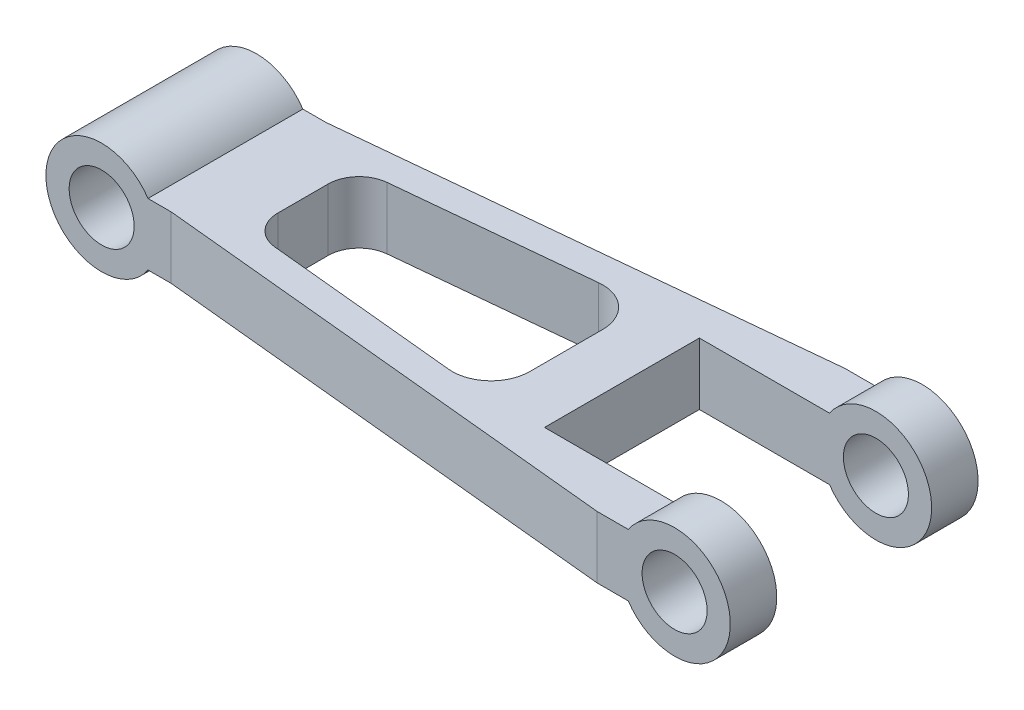
ISO-10303-21;
HEADER;
FILE_DESCRIPTION(('STEP AP214'),'2;1');
FILE_NAME('part.step','',(''),(''),'','','');
FILE_SCHEMA(('AUTOMOTIVE_DESIGN { 1 0 10303 214 1 1 1 1 }'));
ENDSEC;
DATA;
#1=APPLICATION_CONTEXT('core data for automotive mechanical design processes');
#2=APPLICATION_PROTOCOL_DEFINITION('international standard','automotive_design',2000,#1);
#3=PRODUCT_CONTEXT('',#1,'mechanical');
#4=PRODUCT('Part','Part','',(#3));
#5=PRODUCT_RELATED_PRODUCT_CATEGORY('part','',(#4));
#6=PRODUCT_DEFINITION_FORMATION('','',#4);
#7=PRODUCT_DEFINITION_CONTEXT('part definition',#1,'design');
#8=PRODUCT_DEFINITION('design','',#6,#7);
#9=PRODUCT_DEFINITION_SHAPE('','',#8);
#10=(LENGTH_UNIT() NAMED_UNIT(*) SI_UNIT(.MILLI.,.METRE.));
#11=(NAMED_UNIT(*) PLANE_ANGLE_UNIT() SI_UNIT($,.RADIAN.));
#12=(NAMED_UNIT(*) SI_UNIT($,.STERADIAN.) SOLID_ANGLE_UNIT());
#13=UNCERTAINTY_MEASURE_WITH_UNIT(LENGTH_MEASURE(1.E-05),#10,'distance_accuracy_value','');
#14=(GEOMETRIC_REPRESENTATION_CONTEXT(3) GLOBAL_UNCERTAINTY_ASSIGNED_CONTEXT((#13)) GLOBAL_UNIT_ASSIGNED_CONTEXT((#10,
#11,#12)) REPRESENTATION_CONTEXT('',''));
#15=CARTESIAN_POINT('',(0.,0.,0.));
#16=DIRECTION('',(0.,0.,1.));
#17=DIRECTION('',(1.,0.,0.));
#18=AXIS2_PLACEMENT_3D('',#15,#16,#17);
#19=CARTESIAN_POINT('',(400.,0.,160.));
#20=DIRECTION('',(0.,0.,-1.));
#21=DIRECTION('',(-1.,0.,0.));
#22=AXIS2_PLACEMENT_3D('',#19,#20,#21);
#23=CYLINDRICAL_SURFACE('',#22,36.);
#24=CARTESIAN_POINT('',(400.,0.,30.));
#25=DIRECTION('',(0.,0.,1.));
#26=DIRECTION('',(1.,0.,0.));
#27=AXIS2_PLACEMENT_3D('',#24,#25,#26);
#28=CIRCLE('',#27,36.);
#29=CARTESIAN_POINT('',(370.066740905809,-20.,30.));
#30=VERTEX_POINT('',#29);
#31=CARTESIAN_POINT('',(370.066740905809,20.,30.));
#32=VERTEX_POINT('',#31);
#33=EDGE_CURVE('E247',#30,#32,#28,.T.);
#34=ORIENTED_EDGE('',*,*,#33,.F.);
#35=DIRECTION('',(0.,0.,-1.));
#36=VECTOR('',#35,1.);
#37=CARTESIAN_POINT('',(370.066740905809,-20.,160.));
#38=LINE('',#37,#36);
#39=CARTESIAN_POINT('',(370.066740905809,-20.,0.));
#40=VERTEX_POINT('',#39);
#41=EDGE_CURVE('E245',#30,#40,#38,.T.);
#42=ORIENTED_EDGE('',*,*,#41,.T.);
#43=CARTESIAN_POINT('',(400.,0.,0.));
#44=DIRECTION('',(0.,0.,1.));
#45=DIRECTION('',(1.,0.,0.));
#46=AXIS2_PLACEMENT_3D('',#43,#44,#45);
#47=CIRCLE('',#46,36.);
#48=CARTESIAN_POINT('',(370.066740905809,20.,0.));
#49=VERTEX_POINT('',#48);
#50=EDGE_CURVE('E378',#40,#49,#47,.T.);
#51=ORIENTED_EDGE('',*,*,#50,.T.);
#52=DIRECTION('',(0.,0.,-1.));
#53=VECTOR('',#52,1.);
#54=CARTESIAN_POINT('',(370.066740905809,20.,160.));
#55=LINE('',#54,#53);
#56=EDGE_CURVE('E415',#32,#49,#55,.T.);
#57=ORIENTED_EDGE('',*,*,#56,.F.);
#58=EDGE_LOOP('',(#34,#42,#51,#57));
#59=FACE_BOUND('',#58,.T.);
#60=ADVANCED_FACE('F87',(#59),#23,.T.);
#61=CARTESIAN_POINT('',(400.,0.,160.));
#62=DIRECTION('',(0.,0.,-1.));
#63=DIRECTION('',(-1.,0.,0.));
#64=AXIS2_PLACEMENT_3D('',#61,#62,#63);
#65=CYLINDRICAL_SURFACE('',#64,21.);
#66=CARTESIAN_POINT('',(400.,0.,0.));
#67=DIRECTION('',(0.,0.,1.));
#68=DIRECTION('',(1.,0.,0.));
#69=AXIS2_PLACEMENT_3D('',#66,#67,#68);
#70=CIRCLE('',#69,21.);
#71=CARTESIAN_POINT('',(421.,0.,0.));
#72=VERTEX_POINT('',#71);
#73=EDGE_CURVE('E373',#72,#72,#70,.T.);
#74=ORIENTED_EDGE('',*,*,#73,.F.);
#75=EDGE_LOOP('',(#74));
#76=FACE_BOUND('',#75,.T.);
#77=CARTESIAN_POINT('',(400.,0.,30.));
#78=DIRECTION('',(0.,0.,1.));
#79=DIRECTION('',(1.,0.,0.));
#80=AXIS2_PLACEMENT_3D('',#77,#78,#79);
#81=CIRCLE('',#80,21.);
#82=CARTESIAN_POINT('',(421.,0.,30.));
#83=VERTEX_POINT('',#82);
#84=EDGE_CURVE('E253',#83,#83,#81,.T.);
#85=ORIENTED_EDGE('',*,*,#84,.T.);
#86=EDGE_LOOP('',(#85));
#87=FACE_BOUND('',#86,.T.);
#88=ADVANCED_FACE('F476',(#76,#87),#65,.F.);
#89=CARTESIAN_POINT('',(400.,0.,0.));
#90=DIRECTION('',(0.,0.,1.));
#91=DIRECTION('',(1.,0.,0.));
#92=AXIS2_PLACEMENT_3D('',#89,#90,#91);
#93=PLANE('',#92);
#94=ORIENTED_EDGE('',*,*,#73,.T.);
#95=EDGE_LOOP('',(#94));
#96=FACE_BOUND('',#95,.T.);
#97=DIRECTION('',(0.,1.,0.));
#98=VECTOR('',#97,1.);
#99=CARTESIAN_POINT('',(350.,-36.,0.));
#100=LINE('',#99,#98);
#101=CARTESIAN_POINT('',(350.,-20.,0.));
#102=VERTEX_POINT('',#101);
#103=CARTESIAN_POINT('',(350.,20.,0.));
#104=VERTEX_POINT('',#103);
#105=EDGE_CURVE('E333',#102,#104,#100,.T.);
#106=ORIENTED_EDGE('',*,*,#105,.T.);
#107=DIRECTION('',(-1.,0.,0.));
#108=VECTOR('',#107,1.);
#109=CARTESIAN_POINT('',(29.9332590941915,20.,0.));
#110=LINE('',#109,#108);
#111=EDGE_CURVE('E397',#49,#104,#110,.T.);
#112=ORIENTED_EDGE('',*,*,#111,.F.);
#113=ORIENTED_EDGE('',*,*,#50,.F.);
#114=DIRECTION('',(1.,0.,0.));
#115=VECTOR('',#114,1.);
#116=CARTESIAN_POINT('',(29.9332590941915,-20.,0.));
#117=LINE('',#116,#115);
#118=EDGE_CURVE('E387',#102,#40,#117,.T.);
#119=ORIENTED_EDGE('',*,*,#118,.F.);
#120=EDGE_LOOP('',(#106,#112,#113,#119));
#121=FACE_BOUND('',#120,.T.);
#122=ADVANCED_FACE('F497',(#96,#121),#93,.F.);
#123=CARTESIAN_POINT('',(29.9332590941915,20.,160.));
#124=DIRECTION('',(0.,-1.,0.));
#125=DIRECTION('',(0.,0.,-1.));
#126=AXIS2_PLACEMENT_3D('',#123,#124,#125);
#127=PLANE('',#126);
#128=CARTESIAN_POINT('',(100.,20.,96.2626990637358));
#129=DIRECTION('',(0.,-1.,0.));
#130=DIRECTION('',(0.,0.,-1.));
#131=AXIS2_PLACEMENT_3D('',#128,#129,#130);
#132=CIRCLE('',#131,20.);
#133=CARTESIAN_POINT('',(98.042658808453,20.,116.166689001933));
#134=VERTEX_POINT('',#133);
#135=CARTESIAN_POINT('',(80.,20.,96.2626990637356));
#136=VERTEX_POINT('',#135);
#137=EDGE_CURVE('E274',#134,#136,#132,.T.);
#138=ORIENTED_EDGE('',*,*,#137,.T.);
#139=DIRECTION('',(0.,0.,-1.));
#140=VECTOR('',#139,1.);
#141=CARTESIAN_POINT('',(80.,20.,160.));
#142=LINE('',#141,#140);
#143=CARTESIAN_POINT('',(80.,20.,63.7373009362644));
#144=VERTEX_POINT('',#143);
#145=EDGE_CURVE('E323',#136,#144,#142,.T.);
#146=ORIENTED_EDGE('',*,*,#145,.T.);
#147=CARTESIAN_POINT('',(100.,20.,63.7373009362643));
#148=DIRECTION('',(0.,-1.,0.));
#149=DIRECTION('',(0.,0.,-1.));
#150=AXIS2_PLACEMENT_3D('',#147,#148,#149);
#151=CIRCLE('',#150,20.);
#152=CARTESIAN_POINT('',(98.042658808453,20.,43.8333109980666));
#153=VERTEX_POINT('',#152);
#154=EDGE_CURVE('E320',#153,#144,#151,.F.);
#155=ORIENTED_EDGE('',*,*,#154,.F.);
#156=DIRECTION('',(0.995199496909883,0.,-0.0978670595773493));
#157=VECTOR('',#156,1.);
#158=CARTESIAN_POINT('',(19.2712924212823,20.,51.5796191816414));
#159=LINE('',#158,#157);
#160=CARTESIAN_POINT('',(222.553323510566,20.,31.589039695425));
#161=VERTEX_POINT('',#160);
#162=EDGE_CURVE('E316',#153,#161,#159,.T.);
#163=ORIENTED_EDGE('',*,*,#162,.T.);
#164=CARTESIAN_POINT('',(225.,20.,56.469027118172));
#165=DIRECTION('',(0.,-1.,0.));
#166=DIRECTION('',(0.,0.,-1.));
#167=AXIS2_PLACEMENT_3D('',#164,#165,#166);
#168=CIRCLE('',#167,25.);
#169=CARTESIAN_POINT('',(250.,20.,56.469027118172));
#170=VERTEX_POINT('',#169);
#171=EDGE_CURVE('E312',#161,#170,#168,.T.);
#172=ORIENTED_EDGE('',*,*,#171,.T.);
#173=DIRECTION('',(0.,0.,-1.));
#174=VECTOR('',#173,1.);
#175=CARTESIAN_POINT('',(250.,20.,160.));
#176=LINE('',#175,#174);
#177=CARTESIAN_POINT('',(250.,20.,103.530972881828));
#178=VERTEX_POINT('',#177);
#179=EDGE_CURVE('E309',#178,#170,#176,.T.);
#180=ORIENTED_EDGE('',*,*,#179,.F.);
#181=CARTESIAN_POINT('',(225.,20.,103.530972881828));
#182=DIRECTION('',(0.,-1.,0.));
#183=DIRECTION('',(0.,0.,-1.));
#184=AXIS2_PLACEMENT_3D('',#181,#182,#183);
#185=CIRCLE('',#184,25.);
#186=CARTESIAN_POINT('',(222.553323510566,20.,128.410960304575));
#187=VERTEX_POINT('',#186);
#188=EDGE_CURVE('E305',#178,#187,#185,.T.);
#189=ORIENTED_EDGE('',*,*,#188,.T.);
#190=DIRECTION('',(0.995199496909883,0.,0.0978670595773488));
#191=VECTOR('',#190,1.);
#192=CARTESIAN_POINT('',(34.8548521741507,20.,109.952854634409));
#193=LINE('',#192,#191);
#194=EDGE_CURVE('E302',#134,#187,#193,.T.);
#195=ORIENTED_EDGE('',*,*,#194,.F.);
#196=EDGE_LOOP('',(#138,#146,#155,#163,#172,#180,#189,#195));
#197=FACE_BOUND('',#196,.T.);
#198=CARTESIAN_POINT('',(370.066740905809,20.,160.));
#199=VERTEX_POINT('',#198);
#200=CARTESIAN_POINT('',(370.066740905809,20.,130.));
#201=VERTEX_POINT('',#200);
#202=EDGE_CURVE('E416',#199,#201,#55,.T.);
#203=ORIENTED_EDGE('',*,*,#202,.T.);
#204=DIRECTION('',(-1.,0.,0.));
#205=VECTOR('',#204,1.);
#206=CARTESIAN_POINT('',(29.9332590941915,20.,130.));
#207=LINE('',#206,#205);
#208=CARTESIAN_POINT('',(286.,20.,130.));
#209=VERTEX_POINT('',#208);
#210=EDGE_CURVE('E263',#201,#209,#207,.T.);
#211=ORIENTED_EDGE('',*,*,#210,.T.);
#212=DIRECTION('',(0.,0.,1.));
#213=VECTOR('',#212,1.);
#214=CARTESIAN_POINT('',(286.,20.,160.));
#215=LINE('',#214,#213);
#216=CARTESIAN_POINT('',(286.,20.,30.));
#217=VERTEX_POINT('',#216);
#218=EDGE_CURVE('E267',#217,#209,#215,.T.);
#219=ORIENTED_EDGE('',*,*,#218,.F.);
#220=DIRECTION('',(-1.,0.,0.));
#221=VECTOR('',#220,1.);
#222=CARTESIAN_POINT('',(29.9332590941915,20.,30.));
#223=LINE('',#222,#221);
#224=EDGE_CURVE('E239',#32,#217,#223,.T.);
#225=ORIENTED_EDGE('',*,*,#224,.F.);
#226=ORIENTED_EDGE('',*,*,#56,.T.);
#227=ORIENTED_EDGE('',*,*,#111,.T.);
#228=DIRECTION('',(0.995199496909883,0.,-0.0978670595773492));
#229=VECTOR('',#228,1.);
#230=CARTESIAN_POINT('',(17.4152862152407,20.,32.7060937023726));
#231=LINE('',#230,#229);
#232=CARTESIAN_POINT('',(44.9332590941915,20.,30.));
#233=VERTEX_POINT('',#232);
#234=EDGE_CURVE('E370',#233,#104,#231,.T.);
#235=ORIENTED_EDGE('',*,*,#234,.F.);
#236=DIRECTION('',(1.,0.,0.));
#237=VECTOR('',#236,1.);
#238=CARTESIAN_POINT('',(29.9332590941916,20.,30.));
#239=LINE('',#238,#237);
#240=CARTESIAN_POINT('',(29.9332590941915,20.,30.));
#241=VERTEX_POINT('',#240);
#242=EDGE_CURVE('E363',#241,#233,#239,.T.);
#243=ORIENTED_EDGE('',*,*,#242,.F.);
#244=DIRECTION('',(0.,0.,-1.));
#245=VECTOR('',#244,1.);
#246=CARTESIAN_POINT('',(29.9332590941915,20.,160.));
#247=LINE('',#246,#245);
#248=CARTESIAN_POINT('',(29.9332590941915,20.,130.));
#249=VERTEX_POINT('',#248);
#250=EDGE_CURVE('E411',#249,#241,#247,.T.);
#251=ORIENTED_EDGE('',*,*,#250,.F.);
#252=DIRECTION('',(1.,0.,0.));
#253=VECTOR('',#252,1.);
#254=CARTESIAN_POINT('',(29.9332590941916,20.,130.));
#255=LINE('',#254,#253);
#256=CARTESIAN_POINT('',(44.9332590941915,20.,130.));
#257=VERTEX_POINT('',#256);
#258=EDGE_CURVE('E351',#249,#257,#255,.T.);
#259=ORIENTED_EDGE('',*,*,#258,.T.);
#260=DIRECTION('',(0.995199496909883,0.,0.0978670595773489));
#261=VECTOR('',#260,1.);
#262=CARTESIAN_POINT('',(32.9988459681091,20.,128.826380113678));
#263=LINE('',#262,#261);
#264=CARTESIAN_POINT('',(350.,20.,160.));
#265=VERTEX_POINT('',#264);
#266=EDGE_CURVE('E366',#257,#265,#263,.T.);
#267=ORIENTED_EDGE('',*,*,#266,.T.);
#268=DIRECTION('',(-1.,0.,0.));
#269=VECTOR('',#268,1.);
#270=CARTESIAN_POINT('',(29.9332590941915,20.,160.));
#271=LINE('',#270,#269);
#272=EDGE_CURVE('E386',#199,#265,#271,.T.);
#273=ORIENTED_EDGE('',*,*,#272,.F.);
#274=EDGE_LOOP('',(#203,#211,#219,#225,#226,#227,#235,#243,#251,#259,#267,#273));
#275=FACE_BOUND('',#274,.T.);
#276=ADVANCED_FACE('F501',(#197,#275),#127,.F.);
#277=CARTESIAN_POINT('',(0.,0.,160.));
#278=DIRECTION('',(0.,0.,-1.));
#279=DIRECTION('',(-1.,0.,0.));
#280=AXIS2_PLACEMENT_3D('',#277,#278,#279);
#281=CYLINDRICAL_SURFACE('',#280,36.);
#282=CARTESIAN_POINT('',(0.,0.,30.));
#283=DIRECTION('',(0.,0.,-1.));
#284=DIRECTION('',(-1.,0.,0.));
#285=AXIS2_PLACEMENT_3D('',#282,#283,#284);
#286=CIRCLE('',#285,36.);
#287=CARTESIAN_POINT('',(29.9332590941915,-20.,30.));
#288=VERTEX_POINT('',#287);
#289=EDGE_CURVE('E360',#288,#241,#286,.T.);
#290=ORIENTED_EDGE('',*,*,#289,.F.);
#291=DIRECTION('',(0.,0.,-1.));
#292=VECTOR('',#291,1.);
#293=CARTESIAN_POINT('',(29.9332590941915,-20.,160.));
#294=LINE('',#293,#292);
#295=CARTESIAN_POINT('',(29.9332590941915,-20.,130.));
#296=VERTEX_POINT('',#295);
#297=EDGE_CURVE('E407',#296,#288,#294,.T.);
#298=ORIENTED_EDGE('',*,*,#297,.F.);
#299=CARTESIAN_POINT('',(0.,0.,130.));
#300=DIRECTION('',(0.,0.,-1.));
#301=DIRECTION('',(-1.,0.,0.));
#302=AXIS2_PLACEMENT_3D('',#299,#300,#301);
#303=CIRCLE('',#302,36.);
#304=EDGE_CURVE('E347',#296,#249,#303,.T.);
#305=ORIENTED_EDGE('',*,*,#304,.T.);
#306=ORIENTED_EDGE('',*,*,#250,.T.);
#307=EDGE_LOOP('',(#290,#298,#305,#306));
#308=FACE_BOUND('',#307,.T.);
#309=ADVANCED_FACE('F488',(#308),#281,.T.);
#310=CARTESIAN_POINT('',(29.9332590941915,-20.,160.));
#311=DIRECTION('',(0.,1.,0.));
#312=DIRECTION('',(0.,0.,1.));
#313=AXIS2_PLACEMENT_3D('',#310,#311,#312);
#314=PLANE('',#313);
#315=DIRECTION('',(0.,0.,-1.));
#316=VECTOR('',#315,1.);
#317=CARTESIAN_POINT('',(286.,-20.,160.));
#318=LINE('',#317,#316);
#319=CARTESIAN_POINT('',(286.,-20.,130.));
#320=VERTEX_POINT('',#319);
#321=CARTESIAN_POINT('',(286.,-20.,30.));
#322=VERTEX_POINT('',#321);
#323=EDGE_CURVE('E12',#320,#322,#318,.T.);
#324=ORIENTED_EDGE('',*,*,#323,.F.);
#325=DIRECTION('',(1.,0.,0.));
#326=VECTOR('',#325,1.);
#327=CARTESIAN_POINT('',(29.9332590941915,-20.,130.));
#328=LINE('',#327,#326);
#329=CARTESIAN_POINT('',(370.066740905809,-20.,130.));
#330=VERTEX_POINT('',#329);
#331=EDGE_CURVE('E260',#320,#330,#328,.T.);
#332=ORIENTED_EDGE('',*,*,#331,.T.);
#333=CARTESIAN_POINT('',(370.066740905809,-20.,160.));
#334=VERTEX_POINT('',#333);
#335=EDGE_CURVE('E403',#334,#330,#38,.T.);
#336=ORIENTED_EDGE('',*,*,#335,.F.);
#337=DIRECTION('',(1.,0.,0.));
#338=VECTOR('',#337,1.);
#339=CARTESIAN_POINT('',(29.9332590941915,-20.,160.));
#340=LINE('',#339,#338);
#341=CARTESIAN_POINT('',(350.,-20.,160.));
#342=VERTEX_POINT('',#341);
#343=EDGE_CURVE('E391',#342,#334,#340,.T.);
#344=ORIENTED_EDGE('',*,*,#343,.F.);
#345=DIRECTION('',(-0.995199496909883,0.,-0.0978670595773489));
#346=VECTOR('',#345,1.);
#347=CARTESIAN_POINT('',(32.9988459681091,-20.,128.826380113678));
#348=LINE('',#347,#346);
#349=CARTESIAN_POINT('',(44.9332590941915,-20.,130.));
#350=VERTEX_POINT('',#349);
#351=EDGE_CURVE('E420',#342,#350,#348,.T.);
#352=ORIENTED_EDGE('',*,*,#351,.T.);
#353=DIRECTION('',(-1.,0.,0.));
#354=VECTOR('',#353,1.);
#355=CARTESIAN_POINT('',(29.9332590941916,-20.,130.));
#356=LINE('',#355,#354);
#357=EDGE_CURVE('E343',#350,#296,#356,.T.);
#358=ORIENTED_EDGE('',*,*,#357,.T.);
#359=ORIENTED_EDGE('',*,*,#297,.T.);
#360=DIRECTION('',(-1.,0.,0.));
#361=VECTOR('',#360,1.);
#362=CARTESIAN_POINT('',(29.9332590941916,-20.,30.));
#363=LINE('',#362,#361);
#364=CARTESIAN_POINT('',(44.9332590941915,-20.,30.));
#365=VERTEX_POINT('',#364);
#366=EDGE_CURVE('E356',#365,#288,#363,.T.);
#367=ORIENTED_EDGE('',*,*,#366,.F.);
#368=DIRECTION('',(-0.995199496909883,0.,0.0978670595773492));
#369=VECTOR('',#368,1.);
#370=CARTESIAN_POINT('',(17.4152862152407,-20.,32.7060937023726));
#371=LINE('',#370,#369);
#372=EDGE_CURVE('E430',#102,#365,#371,.T.);
#373=ORIENTED_EDGE('',*,*,#372,.F.);
#374=ORIENTED_EDGE('',*,*,#118,.T.);
#375=ORIENTED_EDGE('',*,*,#41,.F.);
#376=DIRECTION('',(1.,0.,0.));
#377=VECTOR('',#376,1.);
#378=CARTESIAN_POINT('',(29.9332590941915,-20.,30.));
#379=LINE('',#378,#377);
#380=EDGE_CURVE('E236',#322,#30,#379,.T.);
#381=ORIENTED_EDGE('',*,*,#380,.F.);
#382=EDGE_LOOP('',(#324,#332,#336,#344,#352,#358,#359,#367,#373,#374,#375,#381));
#383=FACE_BOUND('',#382,.T.);
#384=CARTESIAN_POINT('',(100.,-20.,63.7373009362643));
#385=DIRECTION('',(0.,1.,0.));
#386=DIRECTION('',(0.,0.,1.));
#387=AXIS2_PLACEMENT_3D('',#384,#385,#386);
#388=CIRCLE('',#387,20.);
#389=CARTESIAN_POINT('',(80.,-20.,63.7373009362644));
#390=VERTEX_POINT('',#389);
#391=CARTESIAN_POINT('',(98.042658808453,-20.,43.8333109980666));
#392=VERTEX_POINT('',#391);
#393=EDGE_CURVE('E456',#390,#392,#388,.F.);
#394=ORIENTED_EDGE('',*,*,#393,.F.);
#395=DIRECTION('',(0.,0.,1.));
#396=VECTOR('',#395,1.);
#397=CARTESIAN_POINT('',(80.,-20.,160.));
#398=LINE('',#397,#396);
#399=CARTESIAN_POINT('',(80.,-20.,96.2626990637356));
#400=VERTEX_POINT('',#399);
#401=EDGE_CURVE('E96',#390,#400,#398,.T.);
#402=ORIENTED_EDGE('',*,*,#401,.T.);
#403=CARTESIAN_POINT('',(100.,-20.,96.2626990637358));
#404=DIRECTION('',(0.,1.,0.));
#405=DIRECTION('',(0.,0.,1.));
#406=AXIS2_PLACEMENT_3D('',#403,#404,#405);
#407=CIRCLE('',#406,20.);
#408=CARTESIAN_POINT('',(98.042658808453,-20.,116.166689001933));
#409=VERTEX_POINT('',#408);
#410=EDGE_CURVE('E434',#400,#409,#407,.T.);
#411=ORIENTED_EDGE('',*,*,#410,.T.);
#412=DIRECTION('',(-0.995199496909883,0.,-0.0978670595773488));
#413=VECTOR('',#412,1.);
#414=CARTESIAN_POINT('',(34.8548521741507,-20.,109.952854634409));
#415=LINE('',#414,#413);
#416=CARTESIAN_POINT('',(222.553323510566,-20.,128.410960304575));
#417=VERTEX_POINT('',#416);
#418=EDGE_CURVE('E438',#417,#409,#415,.T.);
#419=ORIENTED_EDGE('',*,*,#418,.F.);
#420=CARTESIAN_POINT('',(225.,-20.,103.530972881828));
#421=DIRECTION('',(0.,1.,0.));
#422=DIRECTION('',(0.,0.,1.));
#423=AXIS2_PLACEMENT_3D('',#420,#421,#422);
#424=CIRCLE('',#423,25.);
#425=CARTESIAN_POINT('',(250.,-20.,103.530972881828));
#426=VERTEX_POINT('',#425);
#427=EDGE_CURVE('E441',#417,#426,#424,.T.);
#428=ORIENTED_EDGE('',*,*,#427,.T.);
#429=DIRECTION('',(0.,0.,1.));
#430=VECTOR('',#429,1.);
#431=CARTESIAN_POINT('',(250.,-20.,160.));
#432=LINE('',#431,#430);
#433=CARTESIAN_POINT('',(250.,-20.,56.469027118172));
#434=VERTEX_POINT('',#433);
#435=EDGE_CURVE('E445',#434,#426,#432,.T.);
#436=ORIENTED_EDGE('',*,*,#435,.F.);
#437=CARTESIAN_POINT('',(225.,-20.,56.469027118172));
#438=DIRECTION('',(0.,1.,0.));
#439=DIRECTION('',(0.,0.,1.));
#440=AXIS2_PLACEMENT_3D('',#437,#438,#439);
#441=CIRCLE('',#440,25.);
#442=CARTESIAN_POINT('',(222.553323510566,-20.,31.589039695425));
#443=VERTEX_POINT('',#442);
#444=EDGE_CURVE('E448',#434,#443,#441,.T.);
#445=ORIENTED_EDGE('',*,*,#444,.T.);
#446=DIRECTION('',(-0.995199496909883,0.,0.0978670595773493));
#447=VECTOR('',#446,1.);
#448=CARTESIAN_POINT('',(19.2712924212823,-20.,51.5796191816414));
#449=LINE('',#448,#447);
#450=EDGE_CURVE('E452',#443,#392,#449,.T.);
#451=ORIENTED_EDGE('',*,*,#450,.T.);
#452=EDGE_LOOP('',(#394,#402,#411,#419,#428,#436,#445,#451));
#453=FACE_BOUND('',#452,.T.);
#454=ADVANCED_FACE('F242',(#383,#453),#314,.F.);
#455=CARTESIAN_POINT('',(400.,0.,160.));
#456=DIRECTION('',(0.,0.,1.));
#457=DIRECTION('',(1.,0.,0.));
#458=AXIS2_PLACEMENT_3D('',#455,#456,#457);
#459=PLANE('',#458);
#460=DIRECTION('',(0.,1.,0.));
#461=VECTOR('',#460,1.);
#462=CARTESIAN_POINT('',(350.,-36.,160.));
#463=LINE('',#462,#461);
#464=EDGE_CURVE('E327',#342,#265,#463,.T.);
#465=ORIENTED_EDGE('',*,*,#464,.F.);
#466=ORIENTED_EDGE('',*,*,#343,.T.);
#467=CARTESIAN_POINT('',(400.,0.,160.));
#468=DIRECTION('',(0.,0.,1.));
#469=DIRECTION('',(1.,0.,0.));
#470=AXIS2_PLACEMENT_3D('',#467,#468,#469);
#471=CIRCLE('',#470,36.);
#472=EDGE_CURVE('E382',#334,#199,#471,.T.);
#473=ORIENTED_EDGE('',*,*,#472,.T.);
#474=ORIENTED_EDGE('',*,*,#272,.T.);
#475=EDGE_LOOP('',(#465,#466,#473,#474));
#476=FACE_BOUND('',#475,.T.);
#477=CARTESIAN_POINT('',(400.,0.,160.));
#478=DIRECTION('',(0.,0.,1.));
#479=DIRECTION('',(1.,0.,0.));
#480=AXIS2_PLACEMENT_3D('',#477,#478,#479);
#481=CIRCLE('',#480,21.);
#482=CARTESIAN_POINT('',(421.,0.,160.));
#483=VERTEX_POINT('',#482);
#484=EDGE_CURVE('E374',#483,#483,#481,.T.);
#485=ORIENTED_EDGE('',*,*,#484,.F.);
#486=EDGE_LOOP('',(#485));
#487=FACE_BOUND('',#486,.T.);
#488=ADVANCED_FACE('F479',(#476,#487),#459,.T.);
#489=ORIENTED_EDGE('',*,*,#335,.T.);
#490=CARTESIAN_POINT('',(400.,0.,130.));
#491=DIRECTION('',(0.,0.,1.));
#492=DIRECTION('',(1.,0.,0.));
#493=AXIS2_PLACEMENT_3D('',#490,#491,#492);
#494=CIRCLE('',#493,36.);
#495=EDGE_CURVE('E256',#330,#201,#494,.T.);
#496=ORIENTED_EDGE('',*,*,#495,.T.);
#497=ORIENTED_EDGE('',*,*,#202,.F.);
#498=ORIENTED_EDGE('',*,*,#472,.F.);
#499=EDGE_LOOP('',(#489,#496,#497,#498));
#500=FACE_BOUND('',#499,.T.);
#501=ADVANCED_FACE('F89',(#500),#23,.T.);
#502=CARTESIAN_POINT('',(400.,0.,130.));
#503=DIRECTION('',(0.,0.,1.));
#504=DIRECTION('',(1.,0.,0.));
#505=AXIS2_PLACEMENT_3D('',#502,#503,#504);
#506=CIRCLE('',#505,21.);
#507=CARTESIAN_POINT('',(421.,0.,130.));
#508=VERTEX_POINT('',#507);
#509=EDGE_CURVE('E251',#508,#508,#506,.T.);
#510=ORIENTED_EDGE('',*,*,#509,.F.);
#511=EDGE_LOOP('',(#510));
#512=FACE_BOUND('',#511,.T.);
#513=ORIENTED_EDGE('',*,*,#484,.T.);
#514=EDGE_LOOP('',(#513));
#515=FACE_BOUND('',#514,.T.);
#516=ADVANCED_FACE('F471',(#512,#515),#65,.F.);
#517=CARTESIAN_POINT('',(-12.2312732802576,-36.,124.37848922455));
#518=DIRECTION('',(0.0978670595773489,0.,-0.995199496909883));
#519=DIRECTION('',(-0.995199496909883,0.,-0.0978670595773489));
#520=AXIS2_PLACEMENT_3D('',#517,#518,#519);
#521=PLANE('',#520);
#522=DIRECTION('',(0.,1.,0.));
#523=VECTOR('',#522,1.);
#524=CARTESIAN_POINT('',(44.9332590941915,-36.,130.));
#525=LINE('',#524,#523);
#526=EDGE_CURVE('E337',#350,#257,#525,.T.);
#527=ORIENTED_EDGE('',*,*,#526,.F.);
#528=ORIENTED_EDGE('',*,*,#351,.F.);
#529=ORIENTED_EDGE('',*,*,#464,.T.);
#530=ORIENTED_EDGE('',*,*,#266,.F.);
#531=EDGE_LOOP('',(#527,#528,#529,#530));
#532=FACE_BOUND('',#531,.T.);
#533=ADVANCED_FACE('F474',(#532),#521,.F.);
#534=CARTESIAN_POINT('',(0.,-36.,130.));
#535=DIRECTION('',(0.,0.,-1.));
#536=DIRECTION('',(-1.,0.,0.));
#537=AXIS2_PLACEMENT_3D('',#534,#535,#536);
#538=PLANE('',#537);
#539=CARTESIAN_POINT('',(0.,0.,130.));
#540=DIRECTION('',(0.,0.,-1.));
#541=DIRECTION('',(-1.,0.,0.));
#542=AXIS2_PLACEMENT_3D('',#539,#540,#541);
#543=CIRCLE('',#542,21.);
#544=CARTESIAN_POINT('',(-21.,0.,130.));
#545=VERTEX_POINT('',#544);
#546=EDGE_CURVE('E332',#545,#545,#543,.T.);
#547=ORIENTED_EDGE('',*,*,#546,.T.);
#548=EDGE_LOOP('',(#547));
#549=FACE_BOUND('',#548,.T.);
#550=ORIENTED_EDGE('',*,*,#304,.F.);
#551=ORIENTED_EDGE('',*,*,#357,.F.);
#552=ORIENTED_EDGE('',*,*,#526,.T.);
#553=ORIENTED_EDGE('',*,*,#258,.F.);
#554=EDGE_LOOP('',(#550,#551,#552,#553));
#555=FACE_BOUND('',#554,.T.);
#556=ADVANCED_FACE('F513',(#549,#555),#538,.F.);
#557=CARTESIAN_POINT('',(3.35228647261075,-36.,34.0890369593996));
#558=DIRECTION('',(-0.0978670595773492,0.,-0.995199496909883));
#559=DIRECTION('',(-0.995199496909883,0.,0.0978670595773492));
#560=AXIS2_PLACEMENT_3D('',#557,#558,#559);
#561=PLANE('',#560);
#562=ORIENTED_EDGE('',*,*,#234,.T.);
#563=ORIENTED_EDGE('',*,*,#105,.F.);
#564=ORIENTED_EDGE('',*,*,#372,.T.);
#565=DIRECTION('',(0.,1.,0.));
#566=VECTOR('',#565,1.);
#567=CARTESIAN_POINT('',(44.9332590941915,-36.,30.));
#568=LINE('',#567,#566);
#569=EDGE_CURVE('E328',#365,#233,#568,.T.);
#570=ORIENTED_EDGE('',*,*,#569,.T.);
#571=EDGE_LOOP('',(#562,#563,#564,#570));
#572=FACE_BOUND('',#571,.T.);
#573=ADVANCED_FACE('F521',(#572),#561,.T.);
#574=CARTESIAN_POINT('',(0.,-36.,30.));
#575=DIRECTION('',(0.,0.,-1.));
#576=DIRECTION('',(-1.,0.,0.));
#577=AXIS2_PLACEMENT_3D('',#574,#575,#576);
#578=PLANE('',#577);
#579=CARTESIAN_POINT('',(0.,0.,30.));
#580=DIRECTION('',(0.,0.,-1.));
#581=DIRECTION('',(-1.,0.,0.));
#582=AXIS2_PLACEMENT_3D('',#579,#580,#581);
#583=CIRCLE('',#582,21.);
#584=CARTESIAN_POINT('',(-21.,0.,30.));
#585=VERTEX_POINT('',#584);
#586=EDGE_CURVE('E355',#585,#585,#583,.T.);
#587=ORIENTED_EDGE('',*,*,#586,.F.);
#588=EDGE_LOOP('',(#587));
#589=FACE_BOUND('',#588,.T.);
#590=ORIENTED_EDGE('',*,*,#242,.T.);
#591=ORIENTED_EDGE('',*,*,#569,.F.);
#592=ORIENTED_EDGE('',*,*,#366,.T.);
#593=ORIENTED_EDGE('',*,*,#289,.T.);
#594=EDGE_LOOP('',(#590,#591,#592,#593));
#595=FACE_BOUND('',#594,.T.);
#596=ADVANCED_FACE('F519',(#589,#595),#578,.T.);
#597=CARTESIAN_POINT('',(0.,0.,160.));
#598=DIRECTION('',(0.,0.,-1.));
#599=DIRECTION('',(-1.,0.,0.));
#600=AXIS2_PLACEMENT_3D('',#597,#598,#599);
#601=CYLINDRICAL_SURFACE('',#600,21.);
#602=ORIENTED_EDGE('',*,*,#546,.F.);
#603=EDGE_LOOP('',(#602));
#604=FACE_BOUND('',#603,.T.);
#605=ORIENTED_EDGE('',*,*,#586,.T.);
#606=EDGE_LOOP('',(#605));
#607=FACE_BOUND('',#606,.T.);
#608=ADVANCED_FACE('F627',(#604,#607),#601,.F.);
#609=CARTESIAN_POINT('',(79.9999999999999,-36.,0.));
#610=DIRECTION('',(-1.,0.,0.));
#611=DIRECTION('',(0.,0.,1.));
#612=AXIS2_PLACEMENT_3D('',#609,#610,#611);
#613=PLANE('',#612);
#614=DIRECTION('',(0.,1.,0.));
#615=VECTOR('',#614,1.);
#616=CARTESIAN_POINT('',(80.,-36.,96.2626990637356));
#617=LINE('',#616,#615);
#618=EDGE_CURVE('E103',#400,#136,#617,.T.);
#619=ORIENTED_EDGE('',*,*,#618,.F.);
#620=ORIENTED_EDGE('',*,*,#401,.F.);
#621=DIRECTION('',(0.,1.,0.));
#622=VECTOR('',#621,1.);
#623=CARTESIAN_POINT('',(80.,-36.,63.7373009362644));
#624=LINE('',#623,#622);
#625=EDGE_CURVE('E270',#390,#144,#624,.T.);
#626=ORIENTED_EDGE('',*,*,#625,.T.);
#627=ORIENTED_EDGE('',*,*,#145,.F.);
#628=EDGE_LOOP('',(#619,#620,#626,#627));
#629=FACE_BOUND('',#628,.T.);
#630=ADVANCED_FACE('F603',(#629),#613,.F.);
#631=CARTESIAN_POINT('',(100.,-36.,63.7373009362643));
#632=DIRECTION('',(0.,1.,0.));
#633=DIRECTION('',(0.,0.,1.));
#634=AXIS2_PLACEMENT_3D('',#631,#632,#633);
#635=CYLINDRICAL_SURFACE('',#634,20.);
#636=ORIENTED_EDGE('',*,*,#154,.T.);
#637=ORIENTED_EDGE('',*,*,#625,.F.);
#638=ORIENTED_EDGE('',*,*,#393,.T.);
#639=DIRECTION('',(0.,1.,0.));
#640=VECTOR('',#639,1.);
#641=CARTESIAN_POINT('',(98.042658808453,-36.,43.8333109980666));
#642=LINE('',#641,#640);
#643=EDGE_CURVE('E275',#392,#153,#642,.T.);
#644=ORIENTED_EDGE('',*,*,#643,.T.);
#645=EDGE_LOOP('',(#636,#637,#638,#644));
#646=FACE_BOUND('',#645,.T.);
#647=ADVANCED_FACE('F599',(#646),#635,.F.);
#648=CARTESIAN_POINT('',(5.20829267865235,-36.,52.9625624386684));
#649=DIRECTION('',(-0.0978670595773494,0.,-0.995199496909883));
#650=DIRECTION('',(-0.995199496909883,0.,0.0978670595773493));
#651=AXIS2_PLACEMENT_3D('',#648,#649,#650);
#652=PLANE('',#651);
#653=ORIENTED_EDGE('',*,*,#643,.F.);
#654=ORIENTED_EDGE('',*,*,#450,.F.);
#655=DIRECTION('',(0.,1.,0.));
#656=VECTOR('',#655,1.);
#657=CARTESIAN_POINT('',(222.553323510566,-36.,31.589039695425));
#658=LINE('',#657,#656);
#659=EDGE_CURVE('E279',#443,#161,#658,.T.);
#660=ORIENTED_EDGE('',*,*,#659,.T.);
#661=ORIENTED_EDGE('',*,*,#162,.F.);
#662=EDGE_LOOP('',(#653,#654,#660,#661));
#663=FACE_BOUND('',#662,.T.);
#664=ADVANCED_FACE('F602',(#663),#652,.F.);
#665=CARTESIAN_POINT('',(225.,-36.,56.469027118172));
#666=DIRECTION('',(0.,1.,0.));
#667=DIRECTION('',(0.,0.,1.));
#668=AXIS2_PLACEMENT_3D('',#665,#666,#667);
#669=CYLINDRICAL_SURFACE('',#668,25.);
#670=ORIENTED_EDGE('',*,*,#659,.F.);
#671=ORIENTED_EDGE('',*,*,#444,.F.);
#672=DIRECTION('',(0.,1.,0.));
#673=VECTOR('',#672,1.);
#674=CARTESIAN_POINT('',(250.,-36.,56.469027118172));
#675=LINE('',#674,#673);
#676=EDGE_CURVE('E283',#434,#170,#675,.T.);
#677=ORIENTED_EDGE('',*,*,#676,.T.);
#678=ORIENTED_EDGE('',*,*,#171,.F.);
#679=EDGE_LOOP('',(#670,#671,#677,#678));
#680=FACE_BOUND('',#679,.T.);
#681=ADVANCED_FACE('F607',(#680),#669,.F.);
#682=CARTESIAN_POINT('',(250.,-36.,0.));
#683=DIRECTION('',(-1.,0.,0.));
#684=DIRECTION('',(0.,0.,1.));
#685=AXIS2_PLACEMENT_3D('',#682,#683,#684);
#686=PLANE('',#685);
#687=ORIENTED_EDGE('',*,*,#179,.T.);
#688=ORIENTED_EDGE('',*,*,#676,.F.);
#689=ORIENTED_EDGE('',*,*,#435,.T.);
#690=DIRECTION('',(0.,1.,0.));
#691=VECTOR('',#690,1.);
#692=CARTESIAN_POINT('',(250.,-36.,103.530972881828));
#693=LINE('',#692,#691);
#694=EDGE_CURVE('E287',#426,#178,#693,.T.);
#695=ORIENTED_EDGE('',*,*,#694,.T.);
#696=EDGE_LOOP('',(#687,#688,#689,#695));
#697=FACE_BOUND('',#696,.T.);
#698=ADVANCED_FACE('F611',(#697),#686,.T.);
#699=CARTESIAN_POINT('',(225.,-36.,103.530972881828));
#700=DIRECTION('',(0.,1.,0.));
#701=DIRECTION('',(0.,0.,1.));
#702=AXIS2_PLACEMENT_3D('',#699,#700,#701);
#703=CYLINDRICAL_SURFACE('',#702,25.);
#704=ORIENTED_EDGE('',*,*,#694,.F.);
#705=ORIENTED_EDGE('',*,*,#427,.F.);
#706=DIRECTION('',(0.,1.,0.));
#707=VECTOR('',#706,1.);
#708=CARTESIAN_POINT('',(222.553323510566,-36.,128.410960304575));
#709=LINE('',#708,#707);
#710=EDGE_CURVE('E291',#417,#187,#709,.T.);
#711=ORIENTED_EDGE('',*,*,#710,.T.);
#712=ORIENTED_EDGE('',*,*,#188,.F.);
#713=EDGE_LOOP('',(#704,#705,#711,#712));
#714=FACE_BOUND('',#713,.T.);
#715=ADVANCED_FACE('F615',(#714),#703,.F.);
#716=CARTESIAN_POINT('',(-10.375267074216,-36.,105.504963745281));
#717=DIRECTION('',(0.0978670595773488,0.,-0.995199496909883));
#718=DIRECTION('',(-0.995199496909883,0.,-0.0978670595773488));
#719=AXIS2_PLACEMENT_3D('',#716,#717,#718);
#720=PLANE('',#719);
#721=ORIENTED_EDGE('',*,*,#194,.T.);
#722=ORIENTED_EDGE('',*,*,#710,.F.);
#723=ORIENTED_EDGE('',*,*,#418,.T.);
#724=DIRECTION('',(0.,1.,0.));
#725=VECTOR('',#724,1.);
#726=CARTESIAN_POINT('',(98.042658808453,-36.,116.166689001933));
#727=LINE('',#726,#725);
#728=EDGE_CURVE('E108',#409,#134,#727,.T.);
#729=ORIENTED_EDGE('',*,*,#728,.T.);
#730=EDGE_LOOP('',(#721,#722,#723,#729));
#731=FACE_BOUND('',#730,.T.);
#732=ADVANCED_FACE('F619',(#731),#720,.T.);
#733=CARTESIAN_POINT('',(100.,-36.,96.2626990637358));
#734=DIRECTION('',(0.,1.,0.));
#735=DIRECTION('',(0.,0.,1.));
#736=AXIS2_PLACEMENT_3D('',#733,#734,#735);
#737=CYLINDRICAL_SURFACE('',#736,20.);
#738=ORIENTED_EDGE('',*,*,#728,.F.);
#739=ORIENTED_EDGE('',*,*,#410,.F.);
#740=ORIENTED_EDGE('',*,*,#618,.T.);
#741=ORIENTED_EDGE('',*,*,#137,.F.);
#742=EDGE_LOOP('',(#738,#739,#740,#741));
#743=FACE_BOUND('',#742,.T.);
#744=ADVANCED_FACE('F570',(#743),#737,.F.);
#745=CARTESIAN_POINT('',(286.,-36.,0.));
#746=DIRECTION('',(1.,0.,0.));
#747=DIRECTION('',(0.,0.,-1.));
#748=AXIS2_PLACEMENT_3D('',#745,#746,#747);
#749=PLANE('',#748);
#750=ORIENTED_EDGE('',*,*,#218,.T.);
#751=DIRECTION('',(0.,1.,0.));
#752=VECTOR('',#751,1.);
#753=CARTESIAN_POINT('',(286.,-36.,130.));
#754=LINE('',#753,#752);
#755=EDGE_CURVE('E229',#320,#209,#754,.T.);
#756=ORIENTED_EDGE('',*,*,#755,.F.);
#757=ORIENTED_EDGE('',*,*,#323,.T.);
#758=DIRECTION('',(0.,1.,0.));
#759=VECTOR('',#758,1.);
#760=CARTESIAN_POINT('',(286.,-36.,30.));
#761=LINE('',#760,#759);
#762=EDGE_CURVE('E226',#322,#217,#761,.T.);
#763=ORIENTED_EDGE('',*,*,#762,.T.);
#764=EDGE_LOOP('',(#750,#756,#757,#763));
#765=FACE_BOUND('',#764,.T.);
#766=ADVANCED_FACE('F225',(#765),#749,.T.);
#767=CARTESIAN_POINT('',(0.,-36.,130.));
#768=DIRECTION('',(0.,0.,1.));
#769=DIRECTION('',(1.,0.,0.));
#770=AXIS2_PLACEMENT_3D('',#767,#768,#769);
#771=PLANE('',#770);
#772=ORIENTED_EDGE('',*,*,#509,.T.);
#773=EDGE_LOOP('',(#772));
#774=FACE_BOUND('',#773,.T.);
#775=ORIENTED_EDGE('',*,*,#495,.F.);
#776=ORIENTED_EDGE('',*,*,#331,.F.);
#777=ORIENTED_EDGE('',*,*,#755,.T.);
#778=ORIENTED_EDGE('',*,*,#210,.F.);
#779=EDGE_LOOP('',(#775,#776,#777,#778));
#780=FACE_BOUND('',#779,.T.);
#781=ADVANCED_FACE('F468',(#774,#780),#771,.F.);
#782=CARTESIAN_POINT('',(0.,-36.,30.));
#783=DIRECTION('',(0.,0.,1.));
#784=DIRECTION('',(1.,0.,0.));
#785=AXIS2_PLACEMENT_3D('',#782,#783,#784);
#786=PLANE('',#785);
#787=ORIENTED_EDGE('',*,*,#84,.F.);
#788=EDGE_LOOP('',(#787));
#789=FACE_BOUND('',#788,.T.);
#790=ORIENTED_EDGE('',*,*,#224,.T.);
#791=ORIENTED_EDGE('',*,*,#762,.F.);
#792=ORIENTED_EDGE('',*,*,#380,.T.);
#793=ORIENTED_EDGE('',*,*,#33,.T.);
#794=EDGE_LOOP('',(#790,#791,#792,#793));
#795=FACE_BOUND('',#794,.T.);
#796=ADVANCED_FACE('F235',(#789,#795),#786,.T.);
#797=CLOSED_SHELL('',(#60,#88,#122,#276,#309,#454,#488,#501,#516,#533,#556,#573,#596,#608,#630,
#647,#664,#681,#698,#715,#732,#744,#766,#781,#796));
#798=MANIFOLD_SOLID_BREP('B2',#797);
#799=ADVANCED_BREP_SHAPE_REPRESENTATION('',(#18,#798),#14);
#800=SHAPE_DEFINITION_REPRESENTATION(#9,#799);
ENDSEC;
END-ISO-10303-21;
